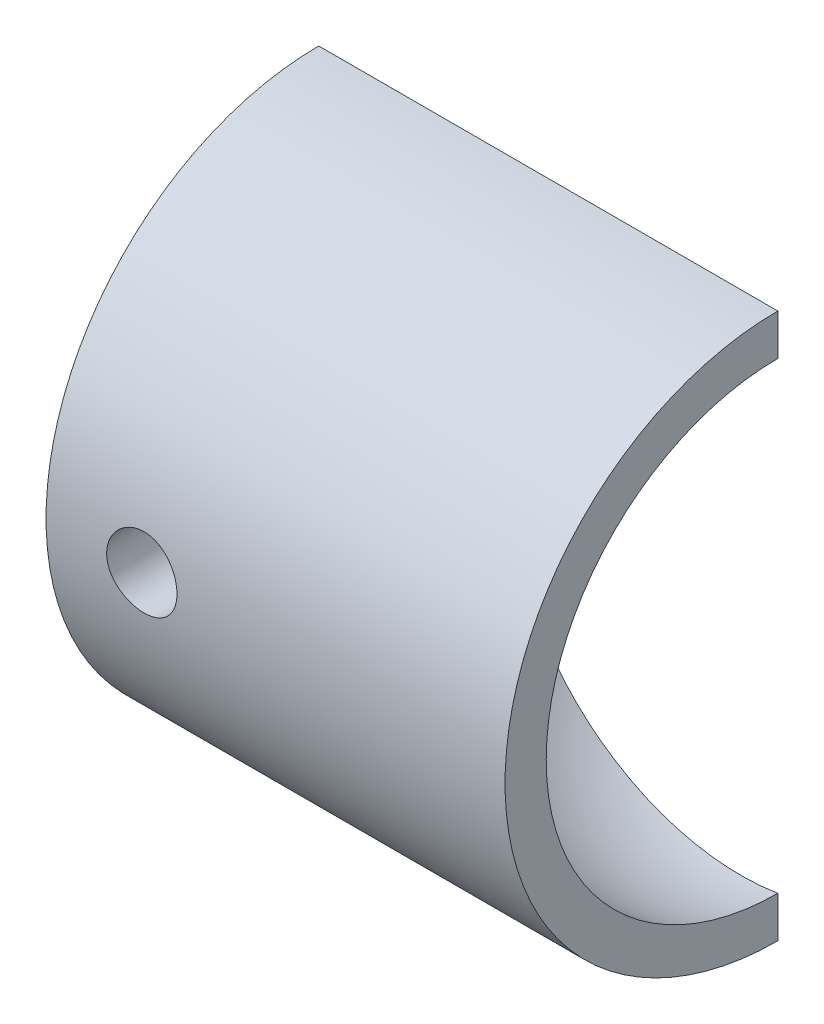
ISO-10303-21;
HEADER;
FILE_DESCRIPTION(('STEP AP214'),'2;1');
FILE_NAME('part.step','',(''),(''),'','','');
FILE_SCHEMA(('AUTOMOTIVE_DESIGN { 1 0 10303 214 1 1 1 1 }'));
ENDSEC;
DATA;
#1=APPLICATION_CONTEXT('core data for automotive mechanical design processes');
#2=APPLICATION_PROTOCOL_DEFINITION('international standard','automotive_design',2000,#1);
#3=PRODUCT_CONTEXT('',#1,'mechanical');
#4=PRODUCT('Part','Part','',(#3));
#5=PRODUCT_RELATED_PRODUCT_CATEGORY('part','',(#4));
#6=PRODUCT_DEFINITION_FORMATION('','',#4);
#7=PRODUCT_DEFINITION_CONTEXT('part definition',#1,'design');
#8=PRODUCT_DEFINITION('design','',#6,#7);
#9=PRODUCT_DEFINITION_SHAPE('','',#8);
#10=(LENGTH_UNIT() NAMED_UNIT(*) SI_UNIT(.MILLI.,.METRE.));
#11=(NAMED_UNIT(*) PLANE_ANGLE_UNIT() SI_UNIT($,.RADIAN.));
#12=(NAMED_UNIT(*) SI_UNIT($,.STERADIAN.) SOLID_ANGLE_UNIT());
#13=UNCERTAINTY_MEASURE_WITH_UNIT(LENGTH_MEASURE(1.E-05),#10,'distance_accuracy_value','');
#14=(GEOMETRIC_REPRESENTATION_CONTEXT(3) GLOBAL_UNCERTAINTY_ASSIGNED_CONTEXT((#13)) GLOBAL_UNIT_ASSIGNED_CONTEXT((#10,
#11,#12)) REPRESENTATION_CONTEXT('',''));
#15=CARTESIAN_POINT('',(0.,0.,0.));
#16=DIRECTION('',(0.,0.,1.));
#17=DIRECTION('',(1.,0.,0.));
#18=AXIS2_PLACEMENT_3D('',#15,#16,#17);
#19=CARTESIAN_POINT('',(0.,0.,0.));
#20=DIRECTION('',(1.,0.,0.));
#21=DIRECTION('',(0.,0.,-1.));
#22=AXIS2_PLACEMENT_3D('',#19,#20,#21);
#23=SPHERICAL_SURFACE('',#22,10.);
#24=CARTESIAN_POINT('',(0.,0.,0.));
#25=DIRECTION('',(0.,0.,1.));
#26=DIRECTION('',(1.,0.,0.));
#27=AXIS2_PLACEMENT_3D('',#24,#25,#26);
#28=CIRCLE('',#27,10.);
#29=CARTESIAN_POINT('',(1.57467527514397,9.87524165668113,0.));
#30=VERTEX_POINT('',#29);
#31=CARTESIAN_POINT('',(1.57467527514397,-9.87524165668113,0.));
#32=VERTEX_POINT('',#31);
#33=EDGE_CURVE('E82',#30,#32,#28,.T.);
#34=ORIENTED_EDGE('',*,*,#33,.F.);
#35=CARTESIAN_POINT('',(1.57467527514397,0.,0.));
#36=DIRECTION('',(1.,0.,0.));
#37=DIRECTION('',(0.,0.,-1.));
#38=AXIS2_PLACEMENT_3D('',#35,#36,#37);
#39=CIRCLE('',#38,9.87524165668113);
#40=EDGE_CURVE('E40',#30,#32,#39,.T.);
#41=ORIENTED_EDGE('',*,*,#40,.T.);
#42=EDGE_LOOP('',(#34,#41));
#43=FACE_BOUND('',#42,.T.);
#44=ADVANCED_FACE('F33',(#43),#23,.F.);
#45=CARTESIAN_POINT('',(1.57467527514397,0.,-9.87524165668113));
#46=DIRECTION('',(1.,0.,0.));
#47=DIRECTION('',(0.,0.,-1.));
#48=AXIS2_PLACEMENT_3D('',#45,#46,#47);
#49=PLANE('',#48);
#50=DIRECTION('',(0.,-1.,0.));
#51=VECTOR('',#50,1.);
#52=CARTESIAN_POINT('',(1.57467527514397,0.,0.));
#53=LINE('',#52,#51);
#54=CARTESIAN_POINT('',(1.57467527514397,11.630777084451,0.));
#55=VERTEX_POINT('',#54);
#56=EDGE_CURVE('E63',#55,#30,#53,.T.);
#57=ORIENTED_EDGE('',*,*,#56,.F.);
#58=CARTESIAN_POINT('',(1.57467527514397,0.,0.));
#59=DIRECTION('',(1.,0.,0.));
#60=DIRECTION('',(0.,0.,-1.));
#61=AXIS2_PLACEMENT_3D('',#58,#59,#60);
#62=CIRCLE('',#61,11.630777084451);
#63=CARTESIAN_POINT('',(1.57467527514397,-11.630777084451,0.));
#64=VERTEX_POINT('',#63);
#65=EDGE_CURVE('E75',#55,#64,#62,.T.);
#66=ORIENTED_EDGE('',*,*,#65,.T.);
#67=EDGE_CURVE('E77',#32,#64,#53,.T.);
#68=ORIENTED_EDGE('',*,*,#67,.F.);
#69=ORIENTED_EDGE('',*,*,#40,.F.);
#70=EDGE_LOOP('',(#57,#66,#68,#69));
#71=FACE_BOUND('',#70,.T.);
#72=ADVANCED_FACE('F73',(#71),#49,.T.);
#73=CARTESIAN_POINT('',(-10.,0.,0.));
#74=DIRECTION('',(1.,0.,0.));
#75=DIRECTION('',(0.,0.,-1.));
#76=AXIS2_PLACEMENT_3D('',#73,#74,#75);
#77=CYLINDRICAL_SURFACE('',#76,11.630777084451);
#78=CARTESIAN_POINT('',(-15.4170309733764,0.,11.630777084451));
#79=CARTESIAN_POINT('',(-15.417027423658,-0.0838821627740466,11.6307758841726));
#80=CARTESIAN_POINT('',(-15.409971027678,-0.167816194358139,11.6298600634595));
#81=CARTESIAN_POINT('',(-15.3819339429105,-0.333347120862436,11.626294771837));
#82=CARTESIAN_POINT('',(-15.3609388588486,-0.414941508524189,11.6236435086775));
#83=CARTESIAN_POINT('',(-15.3056545749007,-0.573372905901309,11.6169059033285));
#84=CARTESIAN_POINT('',(-15.2713744860272,-0.650213134283506,11.6128205448389));
#85=CARTESIAN_POINT('',(-15.190513564294,-0.797035969734252,11.6036686897817));
#86=CARTESIAN_POINT('',(-15.1439347820414,-0.867019717344908,11.5986023568131));
#87=CARTESIAN_POINT('',(-15.0395077633477,-0.998566246714277,11.5880207599127));
#88=CARTESIAN_POINT('',(-14.9816019747874,-1.06008316852831,11.5825032908029));
#89=CARTESIAN_POINT('',(-14.8562883027765,-1.17255473777935,11.5716589773403));
#90=CARTESIAN_POINT('',(-14.7888799266671,-1.22350883725143,11.5663321428889));
#91=CARTESIAN_POINT('',(-14.6461749579958,-1.3135803807567,11.5564505775087));
#92=CARTESIAN_POINT('',(-14.5708508954093,-1.3526546413795,11.5518986892836));
#93=CARTESIAN_POINT('',(-14.4146412804728,-1.417581526803,11.5441116573998));
#94=CARTESIAN_POINT('',(-14.3337559525241,-1.44343468473065,11.540876460648));
#95=CARTESIAN_POINT('',(-14.1691968527697,-1.48104565225317,11.5361102811429));
#96=CARTESIAN_POINT('',(-14.0855410958943,-1.49288107292625,11.5345699181198));
#97=CARTESIAN_POINT('',(-13.9174176674714,-1.5023607980062,11.5333391441066));
#98=CARTESIAN_POINT('',(-13.8329500307653,-1.50000570869995,11.5336486540811));
#99=CARTESIAN_POINT('',(-13.6661425286347,-1.48123493315512,11.5360740712666));
#100=CARTESIAN_POINT('',(-13.5837928445794,-1.46490487677052,11.5381789771561));
#101=CARTESIAN_POINT('',(-13.4230124672239,-1.41878138562911,11.5439408540828));
#102=CARTESIAN_POINT('',(-13.3445818580371,-1.38898766204515,11.5475978584158));
#103=CARTESIAN_POINT('',(-13.1936007764588,-1.31669097185799,11.5560643070258));
#104=CARTESIAN_POINT('',(-13.1210682517416,-1.27415093289035,11.5608771046826));
#105=CARTESIAN_POINT('',(-12.9841389888811,-1.1775956700771,11.5711102926929));
#106=CARTESIAN_POINT('',(-12.9197426469717,-1.12357988770357,11.5765307126133));
#107=CARTESIAN_POINT('',(-12.8004168095684,-1.00513254851909,11.587417262291));
#108=CARTESIAN_POINT('',(-12.7455605298104,-0.940627210122865,11.5928834346823));
#109=CARTESIAN_POINT('',(-12.6474425275906,-0.80328548801248,11.6032082804521));
#110=CARTESIAN_POINT('',(-12.6041808348869,-0.730449082916872,11.6080669522713));
#111=CARTESIAN_POINT('',(-12.5304794506752,-0.578455295629802,11.616632651303));
#112=CARTESIAN_POINT('',(-12.5000444996947,-0.499295589297313,11.6203392525987));
#113=CARTESIAN_POINT('',(-12.4529194669131,-0.336930713139569,11.6261793668721));
#114=CARTESIAN_POINT('',(-12.4362286998598,-0.253725745220499,11.6283129582758));
#115=CARTESIAN_POINT('',(-12.4171610792141,-0.0862651167140417,11.6307564327882));
#116=CARTESIAN_POINT('',(-12.4146833973166,-0.00202111689353039,11.6310791618824));
#117=CARTESIAN_POINT('',(-12.4238459654168,0.165680941195539,11.629899274432));
#118=CARTESIAN_POINT('',(-12.4354858949014,0.249139017263632,11.6283966993275));
#119=CARTESIAN_POINT('',(-12.4724694938746,0.412601486320073,11.623743028231));
#120=CARTESIAN_POINT('',(-12.4977649330017,0.492616970784113,11.6205977354741));
#121=CARTESIAN_POINT('',(-12.5612912578016,0.647270328248036,11.6130106648604));
#122=CARTESIAN_POINT('',(-12.59952260832,0.721908007882185,11.6085688404141));
#123=CARTESIAN_POINT('',(-12.6880783659343,0.86413635626963,11.5988516508));
#124=CARTESIAN_POINT('',(-12.7384678101343,0.93168622309179,11.5935718569163));
#125=CARTESIAN_POINT('',(-12.8498175907913,1.05740595834686,11.5827827885104));
#126=CARTESIAN_POINT('',(-12.9107783749951,1.11557542927363,11.5772735042757));
#127=CARTESIAN_POINT('',(-13.0419852393054,1.22124224393022,11.5666065877872));
#128=CARTESIAN_POINT('',(-13.1122854556468,1.26867263719193,11.5614512940581));
#129=CARTESIAN_POINT('',(-13.2599136712861,1.35105198498669,11.5521149661326));
#130=CARTESIAN_POINT('',(-13.3372415220663,1.38600120321245,11.5479339113538));
#131=CARTESIAN_POINT('',(-13.4965163451699,1.44231840481294,11.5410355442625));
#132=CARTESIAN_POINT('',(-13.5784499200273,1.46372376436853,11.5383142068469));
#133=CARTESIAN_POINT('',(-13.7447859892434,1.49246580321808,11.5346319771154));
#134=CARTESIAN_POINT('',(-13.8291883605046,1.49980318274954,11.5336709971772));
#135=CARTESIAN_POINT('',(-13.9973999177079,1.50018757164631,11.5336209512861));
#136=CARTESIAN_POINT('',(-14.0812088785503,1.49333977201282,11.53451810622));
#137=CARTESIAN_POINT('',(-14.2464738516138,1.46577133137377,11.5380535719147));
#138=CARTESIAN_POINT('',(-14.327929864099,1.44505069192531,11.54069188248));
#139=CARTESIAN_POINT('',(-14.4861605895473,1.39035829557955,11.5474080443451));
#140=CARTESIAN_POINT('',(-14.562937198213,1.3563919465517,11.5514853080943));
#141=CARTESIAN_POINT('',(-14.7097181547455,1.27618265099338,11.5606208995002));
#142=CARTESIAN_POINT('',(-14.779722396166,1.22993951154213,11.5656792425734));
#143=CARTESIAN_POINT('',(-14.9115087438027,1.12610016181155,11.5762519525268));
#144=CARTESIAN_POINT('',(-14.9732288859044,1.06842560848826,11.5817693046041));
#145=CARTESIAN_POINT('',(-15.0861547007304,0.943524589469796,11.5926122135694));
#146=CARTESIAN_POINT('',(-15.1373578969683,0.876295880293118,11.5979377250407));
#147=CARTESIAN_POINT('',(-15.2279741919917,0.733881625989948,11.6078208447943));
#148=CARTESIAN_POINT('',(-15.2673387834932,0.658665008487869,11.6123752611973));
#149=CARTESIAN_POINT('',(-15.3328212582644,0.502671012421821,11.6201708983389));
#150=CARTESIAN_POINT('',(-15.358953436992,0.42189974240116,11.6234135354754));
#151=CARTESIAN_POINT('',(-15.3910216656377,0.283931976366755,11.6274446276849));
#152=CARTESIAN_POINT('',(-15.4007610101703,0.227603020522496,11.628688162922));
#153=CARTESIAN_POINT('',(-15.413766846362,0.114190719389193,11.6303547965859));
#154=CARTESIAN_POINT('',(-15.4170333900417,0.0571073801666792,11.6307779016062));
#155=CARTESIAN_POINT('',(-15.4170309733764,0.,11.630777084451));
#156=B_SPLINE_CURVE_WITH_KNOTS('',3,(#78,#79,#80,#81,#82,#83,#84,#85,#86,#87,#88,#89,#90,#91,
#92,#93,#94,#95,#96,#97,#98,#99,#100,#101,#102,#103,#104,#105,#106,#107,#108,#109,#110,#111,
#112,#113,#114,#115,#116,#117,#118,#119,#120,#121,#122,#123,#124,#125,#126,#127,#128,#129,#130,
#131,#132,#133,#134,#135,#136,#137,#138,#139,#140,#141,#142,#143,#144,#145,#146,#147,#148,#149,
#150,#151,#152,#153,#154,#155),.UNSPECIFIED.,.T.,.F.,(4,2,2,2,2,2,2,2,2,2,2,2,2,2,2,2,2,2,2,2,2,
2,2,2,2,2,2,2,2,2,2,2,2,2,2,2,2,2,4),(0.,0.251437881489057,0.503135841937672,0.754661489566377,
1.00614522583799,1.25894158514141,1.51175105541916,1.76546879777597,2.01917630842674,
2.27147246748851,2.52375784732083,2.77450835856285,3.02526424924543,3.27675665634079,
3.52826130645351,3.78161827254404,4.03497588888259,4.28842705958896,4.54186559305844,
4.7935039765599,5.04513664720352,5.29588632759151,5.54664501950495,5.79877604880951,
6.0509177596791,6.30459057807669,6.55825803675212,6.81122237571023,7.06417412297343,
7.31525680875415,7.56633946635324,7.81731972075149,8.06830391935437,8.32107168631432,
8.573898905904,8.82774836726901,9.0813229975561,9.25250449327472,9.42368461323871),.UNSPECIFIED.);
#157=CARTESIAN_POINT('',(-15.4170309733764,0.,11.630777084451));
#158=VERTEX_POINT('',#157);
#159=EDGE_CURVE('E87',#158,#158,#156,.T.);
#160=ORIENTED_EDGE('',*,*,#159,.F.);
#161=EDGE_LOOP('',(#160));
#162=FACE_BOUND('',#161,.T.);
#163=DIRECTION('',(1.,0.,0.));
#164=VECTOR('',#163,1.);
#165=CARTESIAN_POINT('',(-10.,-11.630777084451,0.));
#166=LINE('',#165,#164);
#167=CARTESIAN_POINT('',(-18.,-11.630777084451,0.));
#168=VERTEX_POINT('',#167);
#169=EDGE_CURVE('E46',#64,#168,#166,.F.);
#170=ORIENTED_EDGE('',*,*,#169,.F.);
#171=ORIENTED_EDGE('',*,*,#65,.F.);
#172=DIRECTION('',(1.,0.,0.));
#173=VECTOR('',#172,1.);
#174=CARTESIAN_POINT('',(-10.,11.630777084451,0.));
#175=LINE('',#174,#173);
#176=CARTESIAN_POINT('',(-18.,11.630777084451,0.));
#177=VERTEX_POINT('',#176);
#178=EDGE_CURVE('E60',#177,#55,#175,.T.);
#179=ORIENTED_EDGE('',*,*,#178,.F.);
#180=CARTESIAN_POINT('',(-18.,0.,0.));
#181=DIRECTION('',(1.,0.,0.));
#182=DIRECTION('',(0.,0.,-1.));
#183=AXIS2_PLACEMENT_3D('',#180,#181,#182);
#184=CIRCLE('',#183,11.630777084451);
#185=EDGE_CURVE('E80',#177,#168,#184,.T.);
#186=ORIENTED_EDGE('',*,*,#185,.T.);
#187=EDGE_LOOP('',(#170,#171,#179,#186));
#188=FACE_BOUND('',#187,.T.);
#189=ADVANCED_FACE('F79',(#162,#188),#77,.T.);
#190=CARTESIAN_POINT('',(-18.,0.,-11.630777084451));
#191=DIRECTION('',(-1.,0.,0.));
#192=DIRECTION('',(0.,0.,1.));
#193=AXIS2_PLACEMENT_3D('',#190,#191,#192);
#194=PLANE('',#193);
#195=DIRECTION('',(0.,1.,0.));
#196=VECTOR('',#195,1.);
#197=CARTESIAN_POINT('',(-18.,0.,0.));
#198=LINE('',#197,#196);
#199=EDGE_CURVE('E11',#168,#177,#198,.T.);
#200=ORIENTED_EDGE('',*,*,#199,.F.);
#201=ORIENTED_EDGE('',*,*,#185,.F.);
#202=EDGE_LOOP('',(#200,#201));
#203=FACE_BOUND('',#202,.T.);
#204=ADVANCED_FACE('F103',(#203),#194,.T.);
#205=CARTESIAN_POINT('',(-48.425324724856,0.,0.));
#206=DIRECTION('',(0.,0.,1.));
#207=DIRECTION('',(1.,0.,0.));
#208=AXIS2_PLACEMENT_3D('',#205,#206,#207);
#209=PLANE('',#208);
#210=CARTESIAN_POINT('',(-13.9170309733764,0.,0.));
#211=DIRECTION('',(0.,0.,-1.));
#212=DIRECTION('',(-1.,0.,0.));
#213=AXIS2_PLACEMENT_3D('',#210,#211,#212);
#214=CIRCLE('',#213,1.5);
#215=CARTESIAN_POINT('',(-15.4170309733764,0.,0.));
#216=VERTEX_POINT('',#215);
#217=EDGE_CURVE('E94',#216,#216,#214,.T.);
#218=ORIENTED_EDGE('',*,*,#217,.F.);
#219=EDGE_LOOP('',(#218));
#220=FACE_BOUND('',#219,.T.);
#221=ORIENTED_EDGE('',*,*,#33,.T.);
#222=ORIENTED_EDGE('',*,*,#67,.T.);
#223=ORIENTED_EDGE('',*,*,#169,.T.);
#224=ORIENTED_EDGE('',*,*,#199,.T.);
#225=ORIENTED_EDGE('',*,*,#178,.T.);
#226=ORIENTED_EDGE('',*,*,#56,.T.);
#227=EDGE_LOOP('',(#221,#222,#223,#224,#225,#226));
#228=FACE_BOUND('',#227,.T.);
#229=ADVANCED_FACE('F62',(#220,#228),#209,.F.);
#230=CARTESIAN_POINT('',(-13.9170309733764,0.,20.));
#231=DIRECTION('',(0.,0.,-1.));
#232=DIRECTION('',(-1.,0.,0.));
#233=AXIS2_PLACEMENT_3D('',#230,#231,#232);
#234=CYLINDRICAL_SURFACE('',#233,1.5);
#235=ORIENTED_EDGE('',*,*,#159,.T.);
#236=EDGE_LOOP('',(#235));
#237=FACE_BOUND('',#236,.T.);
#238=ORIENTED_EDGE('',*,*,#217,.T.);
#239=EDGE_LOOP('',(#238));
#240=FACE_BOUND('',#239,.T.);
#241=ADVANCED_FACE('F97',(#237,#240),#234,.F.);
#242=CLOSED_SHELL('',(#44,#72,#189,#204,#229,#241));
#243=MANIFOLD_SOLID_BREP('B2',#242);
#244=ADVANCED_BREP_SHAPE_REPRESENTATION('',(#18,#243),#14);
#245=SHAPE_DEFINITION_REPRESENTATION(#9,#244);
ENDSEC;
END-ISO-10303-21;
